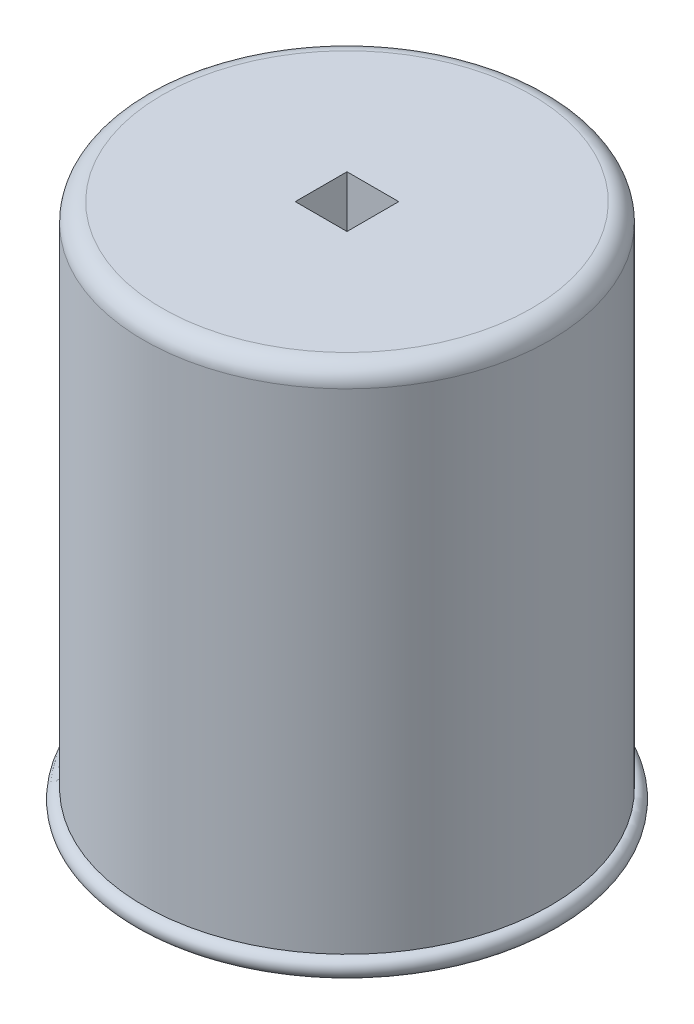
ISO-10303-21;
HEADER;
FILE_DESCRIPTION(('STEP AP214'),'2;1');
FILE_NAME('part.step','',(''),(''),'','','');
FILE_SCHEMA(('AUTOMOTIVE_DESIGN { 1 0 10303 214 1 1 1 1 }'));
ENDSEC;
DATA;
#1=APPLICATION_CONTEXT('core data for automotive mechanical design processes');
#2=APPLICATION_PROTOCOL_DEFINITION('international standard','automotive_design',2000,#1);
#3=PRODUCT_CONTEXT('',#1,'mechanical');
#4=PRODUCT('Part','Part','',(#3));
#5=PRODUCT_RELATED_PRODUCT_CATEGORY('part','',(#4));
#6=PRODUCT_DEFINITION_FORMATION('','',#4);
#7=PRODUCT_DEFINITION_CONTEXT('part definition',#1,'design');
#8=PRODUCT_DEFINITION('design','',#6,#7);
#9=PRODUCT_DEFINITION_SHAPE('','',#8);
#10=(LENGTH_UNIT() NAMED_UNIT(*) SI_UNIT(.MILLI.,.METRE.));
#11=(NAMED_UNIT(*) PLANE_ANGLE_UNIT() SI_UNIT($,.RADIAN.));
#12=(NAMED_UNIT(*) SI_UNIT($,.STERADIAN.) SOLID_ANGLE_UNIT());
#13=UNCERTAINTY_MEASURE_WITH_UNIT(LENGTH_MEASURE(1.E-05),#10,'distance_accuracy_value','');
#14=(GEOMETRIC_REPRESENTATION_CONTEXT(3) GLOBAL_UNCERTAINTY_ASSIGNED_CONTEXT((#13)) GLOBAL_UNIT_ASSIGNED_CONTEXT((#10,
#11,#12)) REPRESENTATION_CONTEXT('',''));
#15=CARTESIAN_POINT('',(0.,0.,0.));
#16=DIRECTION('',(0.,0.,1.));
#17=DIRECTION('',(1.,0.,0.));
#18=AXIS2_PLACEMENT_3D('',#15,#16,#17);
#19=CARTESIAN_POINT('',(0.,0.,0.));
#20=DIRECTION('',(0.,-1.,0.));
#21=DIRECTION('',(1.,0.,0.));
#22=AXIS2_PLACEMENT_3D('',#19,#20,#21);
#23=CYLINDRICAL_SURFACE('',#22,23.);
#24=CARTESIAN_POINT('',(0.,-220.,0.));
#25=DIRECTION('',(0.,-1.,0.));
#26=DIRECTION('',(1.,0.,0.));
#27=AXIS2_PLACEMENT_3D('',#24,#25,#26);
#28=CIRCLE('',#27,23.);
#29=CARTESIAN_POINT('',(23.0000000000001,-220.,0.));
#30=VERTEX_POINT('',#29);
#31=EDGE_CURVE('E287',#30,#30,#28,.T.);
#32=ORIENTED_EDGE('',*,*,#31,.T.);
#33=EDGE_LOOP('',(#32));
#34=FACE_BOUND('',#33,.T.);
#35=CARTESIAN_POINT('',(0.,-149.,0.));
#36=DIRECTION('',(0.,-1.,0.));
#37=DIRECTION('',(1.,0.,0.));
#38=AXIS2_PLACEMENT_3D('',#35,#36,#37);
#39=CIRCLE('',#38,23.);
#40=CARTESIAN_POINT('',(23.,-149.,0.));
#41=VERTEX_POINT('',#40);
#42=EDGE_CURVE('E290',#41,#41,#39,.T.);
#43=ORIENTED_EDGE('',*,*,#42,.F.);
#44=EDGE_LOOP('',(#43));
#45=FACE_BOUND('',#44,.T.);
#46=CARTESIAN_POINT('',(0.,-154.5,0.));
#47=DIRECTION('',(0.,-1.,0.));
#48=DIRECTION('',(0.,0.,1.));
#49=AXIS2_PLACEMENT_3D('',#46,#47,#48);
#50=CIRCLE('',#49,23.);
#51=CARTESIAN_POINT('',(6.63917525773196,-154.5,-22.0209298599564));
#52=VERTEX_POINT('',#51);
#53=CARTESIAN_POINT('',(6.63917525773196,-154.5,22.0209298599564));
#54=VERTEX_POINT('',#53);
#55=EDGE_CURVE('E187',#52,#54,#50,.T.);
#56=ORIENTED_EDGE('',*,*,#55,.T.);
#57=DIRECTION('',(0.,-1.,0.));
#58=VECTOR('',#57,1.);
#59=CARTESIAN_POINT('',(6.63917525773196,-154.5,22.0209298599564));
#60=LINE('',#59,#58);
#61=CARTESIAN_POINT('',(6.63917525773196,-214.5,22.0209298599564));
#62=VERTEX_POINT('',#61);
#63=EDGE_CURVE('E221',#54,#62,#60,.T.);
#64=ORIENTED_EDGE('',*,*,#63,.T.);
#65=CARTESIAN_POINT('',(0.,-214.5,0.));
#66=DIRECTION('',(0.,-1.,0.));
#67=DIRECTION('',(0.,0.,1.));
#68=AXIS2_PLACEMENT_3D('',#65,#66,#67);
#69=CIRCLE('',#68,23.);
#70=CARTESIAN_POINT('',(6.63917525773197,-214.5,-22.0209298599564));
#71=VERTEX_POINT('',#70);
#72=EDGE_CURVE('E206',#71,#62,#69,.T.);
#73=ORIENTED_EDGE('',*,*,#72,.F.);
#74=DIRECTION('',(0.,-1.,0.));
#75=VECTOR('',#74,1.);
#76=CARTESIAN_POINT('',(6.63917525773196,-154.5,-22.0209298599564));
#77=LINE('',#76,#75);
#78=EDGE_CURVE('E224',#52,#71,#77,.T.);
#79=ORIENTED_EDGE('',*,*,#78,.F.);
#80=EDGE_LOOP('',(#56,#64,#73,#79));
#81=FACE_BOUND('',#80,.T.);
#82=ADVANCED_FACE('F38',(#34,#45,#81),#23,.F.);
#83=CARTESIAN_POINT('',(0.,0.,0.));
#84=DIRECTION('',(0.,-1.,0.));
#85=DIRECTION('',(1.,0.,0.));
#86=AXIS2_PLACEMENT_3D('',#83,#84,#85);
#87=CYLINDRICAL_SURFACE('',#86,28.);
#88=CARTESIAN_POINT('',(0.,35.,0.));
#89=DIRECTION('',(0.,-1.,0.));
#90=DIRECTION('',(1.,0.,0.));
#91=AXIS2_PLACEMENT_3D('',#88,#89,#90);
#92=CIRCLE('',#91,28.);
#93=CARTESIAN_POINT('',(28.,35.,0.));
#94=VERTEX_POINT('',#93);
#95=EDGE_CURVE('E275',#94,#94,#92,.T.);
#96=ORIENTED_EDGE('',*,*,#95,.T.);
#97=EDGE_LOOP('',(#96));
#98=FACE_BOUND('',#97,.T.);
#99=CARTESIAN_POINT('',(0.,-225.,0.));
#100=DIRECTION('',(0.,-1.,0.));
#101=DIRECTION('',(1.,0.,0.));
#102=AXIS2_PLACEMENT_3D('',#99,#100,#101);
#103=CIRCLE('',#102,28.);
#104=CARTESIAN_POINT('',(28.,-225.,0.));
#105=VERTEX_POINT('',#104);
#106=EDGE_CURVE('E278',#105,#105,#103,.T.);
#107=ORIENTED_EDGE('',*,*,#106,.F.);
#108=EDGE_LOOP('',(#107));
#109=FACE_BOUND('',#108,.T.);
#110=CARTESIAN_POINT('',(0.,-154.5,0.));
#111=DIRECTION('',(0.,1.,0.));
#112=DIRECTION('',(0.,0.,-1.));
#113=AXIS2_PLACEMENT_3D('',#110,#111,#112);
#114=CIRCLE('',#113,28.);
#115=CARTESIAN_POINT('',(0.,-154.5,28.));
#116=VERTEX_POINT('',#115);
#117=CARTESIAN_POINT('',(0.,-154.5,-28.));
#118=VERTEX_POINT('',#117);
#119=EDGE_CURVE('E177',#116,#118,#114,.T.);
#120=ORIENTED_EDGE('',*,*,#119,.T.);
#121=DIRECTION('',(0.,-1.,0.));
#122=VECTOR('',#121,1.);
#123=CARTESIAN_POINT('',(0.,-154.5,-28.));
#124=LINE('',#123,#122);
#125=CARTESIAN_POINT('',(0.,-214.5,-28.));
#126=VERTEX_POINT('',#125);
#127=EDGE_CURVE('E232',#118,#126,#124,.T.);
#128=ORIENTED_EDGE('',*,*,#127,.T.);
#129=CARTESIAN_POINT('',(0.,-214.5,0.));
#130=DIRECTION('',(0.,1.,0.));
#131=DIRECTION('',(0.,0.,-1.));
#132=AXIS2_PLACEMENT_3D('',#129,#130,#131);
#133=CIRCLE('',#132,28.);
#134=CARTESIAN_POINT('',(0.,-214.5,28.));
#135=VERTEX_POINT('',#134);
#136=EDGE_CURVE('E172',#135,#126,#133,.T.);
#137=ORIENTED_EDGE('',*,*,#136,.F.);
#138=DIRECTION('',(0.,-1.,0.));
#139=VECTOR('',#138,1.);
#140=CARTESIAN_POINT('',(0.,-154.5,28.));
#141=LINE('',#140,#139);
#142=EDGE_CURVE('E196',#116,#135,#141,.T.);
#143=ORIENTED_EDGE('',*,*,#142,.F.);
#144=EDGE_LOOP('',(#120,#128,#137,#143));
#145=FACE_BOUND('',#144,.T.);
#146=ADVANCED_FACE('F321',(#98,#109,#145),#87,.T.);
#147=CARTESIAN_POINT('',(-23.,0.,0.));
#148=DIRECTION('',(0.,1.,0.));
#149=DIRECTION('',(-1.,0.,0.));
#150=AXIS2_PLACEMENT_3D('',#147,#148,#149);
#151=PLANE('',#150);
#152=CARTESIAN_POINT('',(0.,0.,0.));
#153=DIRECTION('',(0.,-1.,0.));
#154=DIRECTION('',(1.,0.,0.));
#155=AXIS2_PLACEMENT_3D('',#152,#153,#154);
#156=CIRCLE('',#155,23.);
#157=CARTESIAN_POINT('',(23.,0.,0.));
#158=VERTEX_POINT('',#157);
#159=EDGE_CURVE('E302',#158,#158,#156,.T.);
#160=ORIENTED_EDGE('',*,*,#159,.T.);
#161=EDGE_LOOP('',(#160));
#162=FACE_BOUND('',#161,.T.);
#163=DIRECTION('',(1.,0.,0.));
#164=VECTOR('',#163,1.);
#165=CARTESIAN_POINT('',(-14.,0.,-14.));
#166=LINE('',#165,#164);
#167=CARTESIAN_POINT('',(-14.,0.,-14.));
#168=VERTEX_POINT('',#167);
#169=CARTESIAN_POINT('',(14.,0.,-14.));
#170=VERTEX_POINT('',#169);
#171=EDGE_CURVE('E236',#168,#170,#166,.T.);
#172=ORIENTED_EDGE('',*,*,#171,.F.);
#173=DIRECTION('',(0.,0.,-1.));
#174=VECTOR('',#173,1.);
#175=CARTESIAN_POINT('',(-14.,0.,-14.));
#176=LINE('',#175,#174);
#177=CARTESIAN_POINT('',(-14.,0.,14.));
#178=VERTEX_POINT('',#177);
#179=EDGE_CURVE('E256',#178,#168,#176,.T.);
#180=ORIENTED_EDGE('',*,*,#179,.F.);
#181=DIRECTION('',(-1.,0.,0.));
#182=VECTOR('',#181,1.);
#183=CARTESIAN_POINT('',(-14.,0.,14.));
#184=LINE('',#183,#182);
#185=CARTESIAN_POINT('',(14.,0.,14.));
#186=VERTEX_POINT('',#185);
#187=EDGE_CURVE('E254',#186,#178,#184,.T.);
#188=ORIENTED_EDGE('',*,*,#187,.F.);
#189=DIRECTION('',(0.,0.,1.));
#190=VECTOR('',#189,1.);
#191=CARTESIAN_POINT('',(14.,0.,-14.));
#192=LINE('',#191,#190);
#193=EDGE_CURVE('E239',#170,#186,#192,.T.);
#194=ORIENTED_EDGE('',*,*,#193,.F.);
#195=EDGE_LOOP('',(#172,#180,#188,#194));
#196=FACE_BOUND('',#195,.T.);
#197=ADVANCED_FACE('F327',(#162,#196),#151,.F.);
#198=CARTESIAN_POINT('',(0.,0.,0.));
#199=DIRECTION('',(0.,-1.,0.));
#200=DIRECTION('',(1.,0.,0.));
#201=AXIS2_PLACEMENT_3D('',#198,#199,#200);
#202=CYLINDRICAL_SURFACE('',#201,23.);
#203=ORIENTED_EDGE('',*,*,#159,.F.);
#204=EDGE_LOOP('',(#203));
#205=FACE_BOUND('',#204,.T.);
#206=CARTESIAN_POINT('',(0.,-144.,0.));
#207=DIRECTION('',(0.,-1.,0.));
#208=DIRECTION('',(1.,0.,0.));
#209=AXIS2_PLACEMENT_3D('',#206,#207,#208);
#210=CIRCLE('',#209,23.);
#211=CARTESIAN_POINT('',(23.0000000000001,-144.,0.));
#212=VERTEX_POINT('',#211);
#213=EDGE_CURVE('E299',#212,#212,#210,.T.);
#214=ORIENTED_EDGE('',*,*,#213,.T.);
#215=EDGE_LOOP('',(#214));
#216=FACE_BOUND('',#215,.T.);
#217=ADVANCED_FACE('F345',(#205,#216),#202,.F.);
#218=CARTESIAN_POINT('',(-5.,-144.,0.));
#219=DIRECTION('',(0.,-1.,0.));
#220=DIRECTION('',(1.,0.,0.));
#221=AXIS2_PLACEMENT_3D('',#218,#219,#220);
#222=PLANE('',#221);
#223=DIRECTION('',(-1.,0.,0.));
#224=VECTOR('',#223,1.);
#225=CARTESIAN_POINT('',(11.5,-144.,-2.5));
#226=LINE('',#225,#224);
#227=CARTESIAN_POINT('',(16.5,-144.,-2.5));
#228=VERTEX_POINT('',#227);
#229=CARTESIAN_POINT('',(11.5,-144.,-2.5));
#230=VERTEX_POINT('',#229);
#231=EDGE_CURVE('E155',#228,#230,#226,.T.);
#232=ORIENTED_EDGE('',*,*,#231,.F.);
#233=DIRECTION('',(0.,0.,-1.));
#234=VECTOR('',#233,1.);
#235=CARTESIAN_POINT('',(16.5,-144.,2.5));
#236=LINE('',#235,#234);
#237=CARTESIAN_POINT('',(16.5,-144.,2.5));
#238=VERTEX_POINT('',#237);
#239=EDGE_CURVE('E162',#238,#228,#236,.T.);
#240=ORIENTED_EDGE('',*,*,#239,.F.);
#241=DIRECTION('',(1.,0.,0.));
#242=VECTOR('',#241,1.);
#243=CARTESIAN_POINT('',(11.5,-144.,2.5));
#244=LINE('',#243,#242);
#245=CARTESIAN_POINT('',(11.5,-144.,2.5));
#246=VERTEX_POINT('',#245);
#247=EDGE_CURVE('E167',#246,#238,#244,.T.);
#248=ORIENTED_EDGE('',*,*,#247,.F.);
#249=DIRECTION('',(0.,0.,1.));
#250=VECTOR('',#249,1.);
#251=CARTESIAN_POINT('',(11.5,-144.,2.5));
#252=LINE('',#251,#250);
#253=EDGE_CURVE('E53',#230,#246,#252,.T.);
#254=ORIENTED_EDGE('',*,*,#253,.F.);
#255=EDGE_LOOP('',(#232,#240,#248,#254));
#256=FACE_BOUND('',#255,.T.);
#257=ORIENTED_EDGE('',*,*,#213,.F.);
#258=EDGE_LOOP('',(#257));
#259=FACE_BOUND('',#258,.T.);
#260=CARTESIAN_POINT('',(0.,-144.,0.));
#261=DIRECTION('',(0.,-1.,0.));
#262=DIRECTION('',(1.,0.,0.));
#263=AXIS2_PLACEMENT_3D('',#260,#261,#262);
#264=CIRCLE('',#263,5.00000000000003);
#265=CARTESIAN_POINT('',(5.00000000000005,-144.,0.));
#266=VERTEX_POINT('',#265);
#267=EDGE_CURVE('E296',#266,#266,#264,.T.);
#268=ORIENTED_EDGE('',*,*,#267,.T.);
#269=EDGE_LOOP('',(#268));
#270=FACE_BOUND('',#269,.T.);
#271=ADVANCED_FACE('F169',(#256,#259,#270),#222,.F.);
#272=CARTESIAN_POINT('',(0.,0.,0.));
#273=DIRECTION('',(0.,-1.,0.));
#274=DIRECTION('',(1.,0.,0.));
#275=AXIS2_PLACEMENT_3D('',#272,#273,#274);
#276=CYLINDRICAL_SURFACE('',#275,5.00000000000003);
#277=ORIENTED_EDGE('',*,*,#267,.F.);
#278=EDGE_LOOP('',(#277));
#279=FACE_BOUND('',#278,.T.);
#280=CARTESIAN_POINT('',(0.,-149.,0.));
#281=DIRECTION('',(0.,-1.,0.));
#282=DIRECTION('',(1.,0.,0.));
#283=AXIS2_PLACEMENT_3D('',#280,#281,#282);
#284=CIRCLE('',#283,5.00000000000003);
#285=CARTESIAN_POINT('',(5.00000000000006,-149.,0.));
#286=VERTEX_POINT('',#285);
#287=EDGE_CURVE('E293',#286,#286,#284,.T.);
#288=ORIENTED_EDGE('',*,*,#287,.T.);
#289=EDGE_LOOP('',(#288));
#290=FACE_BOUND('',#289,.T.);
#291=ADVANCED_FACE('F338',(#279,#290),#276,.F.);
#292=CARTESIAN_POINT('',(-23.,-149.,0.));
#293=DIRECTION('',(0.,1.,0.));
#294=DIRECTION('',(-1.,0.,0.));
#295=AXIS2_PLACEMENT_3D('',#292,#293,#294);
#296=PLANE('',#295);
#297=DIRECTION('',(-1.,0.,0.));
#298=VECTOR('',#297,1.);
#299=CARTESIAN_POINT('',(11.5,-149.,2.5));
#300=LINE('',#299,#298);
#301=CARTESIAN_POINT('',(16.5,-149.,2.5));
#302=VERTEX_POINT('',#301);
#303=CARTESIAN_POINT('',(11.5,-149.,2.5));
#304=VERTEX_POINT('',#303);
#305=EDGE_CURVE('E681',#302,#304,#300,.T.);
#306=ORIENTED_EDGE('',*,*,#305,.F.);
#307=DIRECTION('',(0.,0.,1.));
#308=VECTOR('',#307,1.);
#309=CARTESIAN_POINT('',(16.5,-149.,2.5));
#310=LINE('',#309,#308);
#311=CARTESIAN_POINT('',(16.5,-149.,-2.5));
#312=VERTEX_POINT('',#311);
#313=EDGE_CURVE('E61',#312,#302,#310,.T.);
#314=ORIENTED_EDGE('',*,*,#313,.F.);
#315=DIRECTION('',(1.,0.,0.));
#316=VECTOR('',#315,1.);
#317=CARTESIAN_POINT('',(11.5,-149.,-2.5));
#318=LINE('',#317,#316);
#319=CARTESIAN_POINT('',(11.5,-149.,-2.5));
#320=VERTEX_POINT('',#319);
#321=EDGE_CURVE('E157',#320,#312,#318,.T.);
#322=ORIENTED_EDGE('',*,*,#321,.F.);
#323=DIRECTION('',(0.,0.,-1.));
#324=VECTOR('',#323,1.);
#325=CARTESIAN_POINT('',(11.5,-149.,2.5));
#326=LINE('',#325,#324);
#327=EDGE_CURVE('E683',#304,#320,#326,.T.);
#328=ORIENTED_EDGE('',*,*,#327,.F.);
#329=EDGE_LOOP('',(#306,#314,#322,#328));
#330=FACE_BOUND('',#329,.T.);
#331=ORIENTED_EDGE('',*,*,#287,.F.);
#332=EDGE_LOOP('',(#331));
#333=FACE_BOUND('',#332,.T.);
#334=ORIENTED_EDGE('',*,*,#42,.T.);
#335=EDGE_LOOP('',(#334));
#336=FACE_BOUND('',#335,.T.);
#337=ADVANCED_FACE('F335',(#330,#333,#336),#296,.F.);
#338=CARTESIAN_POINT('',(-4.99999999999997,-220.,0.));
#339=DIRECTION('',(0.,-1.,0.));
#340=DIRECTION('',(1.,0.,0.));
#341=AXIS2_PLACEMENT_3D('',#338,#339,#340);
#342=PLANE('',#341);
#343=ORIENTED_EDGE('',*,*,#31,.F.);
#344=EDGE_LOOP('',(#343));
#345=FACE_BOUND('',#344,.T.);
#346=CARTESIAN_POINT('',(0.,-220.,0.));
#347=DIRECTION('',(0.,-1.,0.));
#348=DIRECTION('',(1.,0.,0.));
#349=AXIS2_PLACEMENT_3D('',#346,#347,#348);
#350=CIRCLE('',#349,5.00000000000001);
#351=CARTESIAN_POINT('',(5.00000000000005,-220.,0.));
#352=VERTEX_POINT('',#351);
#353=EDGE_CURVE('E284',#352,#352,#350,.T.);
#354=ORIENTED_EDGE('',*,*,#353,.T.);
#355=EDGE_LOOP('',(#354));
#356=FACE_BOUND('',#355,.T.);
#357=ADVANCED_FACE('F333',(#345,#356),#342,.F.);
#358=CARTESIAN_POINT('',(0.,0.,0.));
#359=DIRECTION('',(0.,-1.,0.));
#360=DIRECTION('',(1.,0.,0.));
#361=AXIS2_PLACEMENT_3D('',#358,#359,#360);
#362=CYLINDRICAL_SURFACE('',#361,5.00000000000001);
#363=ORIENTED_EDGE('',*,*,#353,.F.);
#364=EDGE_LOOP('',(#363));
#365=FACE_BOUND('',#364,.T.);
#366=CARTESIAN_POINT('',(0.,-225.,0.));
#367=DIRECTION('',(0.,-1.,0.));
#368=DIRECTION('',(1.,0.,0.));
#369=AXIS2_PLACEMENT_3D('',#366,#367,#368);
#370=CIRCLE('',#369,5.00000000000001);
#371=CARTESIAN_POINT('',(5.00000000000005,-225.,0.));
#372=VERTEX_POINT('',#371);
#373=EDGE_CURVE('E281',#372,#372,#370,.T.);
#374=ORIENTED_EDGE('',*,*,#373,.T.);
#375=EDGE_LOOP('',(#374));
#376=FACE_BOUND('',#375,.T.);
#377=ADVANCED_FACE('F398',(#365,#376),#362,.F.);
#378=CARTESIAN_POINT('',(-28.,-225.,0.));
#379=DIRECTION('',(0.,1.,0.));
#380=DIRECTION('',(-1.,0.,0.));
#381=AXIS2_PLACEMENT_3D('',#378,#379,#380);
#382=PLANE('',#381);
#383=ORIENTED_EDGE('',*,*,#373,.F.);
#384=EDGE_LOOP('',(#383));
#385=FACE_BOUND('',#384,.T.);
#386=ORIENTED_EDGE('',*,*,#106,.T.);
#387=EDGE_LOOP('',(#386));
#388=FACE_BOUND('',#387,.T.);
#389=ADVANCED_FACE('F394',(#385,#388),#382,.F.);
#390=CARTESIAN_POINT('',(-105.,35.,0.));
#391=DIRECTION('',(0.,1.,0.));
#392=DIRECTION('',(-1.,0.,0.));
#393=AXIS2_PLACEMENT_3D('',#390,#391,#392);
#394=PLANE('',#393);
#395=ORIENTED_EDGE('',*,*,#95,.F.);
#396=EDGE_LOOP('',(#395));
#397=FACE_BOUND('',#396,.T.);
#398=CARTESIAN_POINT('',(0.,35.,0.));
#399=DIRECTION('',(0.,-1.,0.));
#400=DIRECTION('',(1.,0.,0.));
#401=AXIS2_PLACEMENT_3D('',#398,#399,#400);
#402=CIRCLE('',#401,105.);
#403=CARTESIAN_POINT('',(105.,35.,0.));
#404=VERTEX_POINT('',#403);
#405=EDGE_CURVE('E272',#404,#404,#402,.T.);
#406=ORIENTED_EDGE('',*,*,#405,.T.);
#407=EDGE_LOOP('',(#406));
#408=FACE_BOUND('',#407,.T.);
#409=ADVANCED_FACE('F391',(#397,#408),#394,.F.);
#410=CARTESIAN_POINT('',(0.,0.,0.));
#411=DIRECTION('',(0.,-1.,0.));
#412=DIRECTION('',(1.,0.,0.));
#413=AXIS2_PLACEMENT_3D('',#410,#411,#412);
#414=CYLINDRICAL_SURFACE('',#413,105.);
#415=ORIENTED_EDGE('',*,*,#405,.F.);
#416=EDGE_LOOP('',(#415));
#417=FACE_BOUND('',#416,.T.);
#418=CARTESIAN_POINT('',(0.,-240.,0.));
#419=DIRECTION('',(0.,-1.,0.));
#420=DIRECTION('',(1.,0.,0.));
#421=AXIS2_PLACEMENT_3D('',#418,#419,#420);
#422=CIRCLE('',#421,105.);
#423=CARTESIAN_POINT('',(105.,-240.,0.));
#424=VERTEX_POINT('',#423);
#425=EDGE_CURVE('E269',#424,#424,#422,.T.);
#426=ORIENTED_EDGE('',*,*,#425,.T.);
#427=EDGE_LOOP('',(#426));
#428=FACE_BOUND('',#427,.T.);
#429=ADVANCED_FACE('F387',(#417,#428),#414,.F.);
#430=CARTESIAN_POINT('',(0.,-240.,0.));
#431=DIRECTION('',(0.,-1.,0.));
#432=DIRECTION('',(1.,0.,0.));
#433=AXIS2_PLACEMENT_3D('',#430,#431,#432);
#434=TOROIDAL_SURFACE('',#433,110.,5.00000000000001);
#435=ORIENTED_EDGE('',*,*,#425,.F.);
#436=EDGE_LOOP('',(#435));
#437=FACE_BOUND('',#436,.T.);
#438=CARTESIAN_POINT('',(0.,-235.,0.));
#439=DIRECTION('',(0.,-1.,0.));
#440=DIRECTION('',(1.,0.,0.));
#441=AXIS2_PLACEMENT_3D('',#438,#439,#440);
#442=CIRCLE('',#441,110.);
#443=CARTESIAN_POINT('',(110.,-235.,0.));
#444=VERTEX_POINT('',#443);
#445=EDGE_CURVE('E259',#444,#444,#442,.T.);
#446=ORIENTED_EDGE('',*,*,#445,.T.);
#447=EDGE_LOOP('',(#446));
#448=FACE_BOUND('',#447,.T.);
#449=ADVANCED_FACE('F381',(#437,#448),#434,.T.);
#450=CARTESIAN_POINT('',(0.,0.,0.));
#451=DIRECTION('',(0.,-1.,0.));
#452=DIRECTION('',(1.,0.,0.));
#453=AXIS2_PLACEMENT_3D('',#450,#451,#452);
#454=CYLINDRICAL_SURFACE('',#453,110.);
#455=CARTESIAN_POINT('',(0.,30.,0.));
#456=DIRECTION('',(0.,-1.,0.));
#457=DIRECTION('',(1.,0.,0.));
#458=AXIS2_PLACEMENT_3D('',#455,#456,#457);
#459=CIRCLE('',#458,110.);
#460=CARTESIAN_POINT('',(110.,30.,0.));
#461=VERTEX_POINT('',#460);
#462=EDGE_CURVE('E46',#461,#461,#459,.T.);
#463=ORIENTED_EDGE('',*,*,#462,.T.);
#464=EDGE_LOOP('',(#463));
#465=FACE_BOUND('',#464,.T.);
#466=ORIENTED_EDGE('',*,*,#445,.F.);
#467=EDGE_LOOP('',(#466));
#468=FACE_BOUND('',#467,.T.);
#469=ADVANCED_FACE('F307',(#465,#468),#454,.T.);
#470=CARTESIAN_POINT('',(0.,40.,0.));
#471=DIRECTION('',(0.,-1.,0.));
#472=DIRECTION('',(1.,0.,0.));
#473=AXIS2_PLACEMENT_3D('',#470,#471,#472);
#474=PLANE('',#473);
#475=CARTESIAN_POINT('',(0.,40.,0.));
#476=DIRECTION('',(0.,-1.,0.));
#477=DIRECTION('',(1.,0.,0.));
#478=AXIS2_PLACEMENT_3D('',#475,#476,#477);
#479=CIRCLE('',#478,100.);
#480=CARTESIAN_POINT('',(100.,40.,0.));
#481=VERTEX_POINT('',#480);
#482=EDGE_CURVE('E11',#481,#481,#479,.F.);
#483=ORIENTED_EDGE('',*,*,#482,.T.);
#484=EDGE_LOOP('',(#483));
#485=FACE_BOUND('',#484,.T.);
#486=DIRECTION('',(-1.,0.,0.));
#487=VECTOR('',#486,1.);
#488=CARTESIAN_POINT('',(-14.,40.,-14.));
#489=LINE('',#488,#487);
#490=CARTESIAN_POINT('',(14.,40.,-14.));
#491=VERTEX_POINT('',#490);
#492=CARTESIAN_POINT('',(-14.,40.,-14.));
#493=VERTEX_POINT('',#492);
#494=EDGE_CURVE('E246',#491,#493,#489,.T.);
#495=ORIENTED_EDGE('',*,*,#494,.F.);
#496=DIRECTION('',(0.,0.,-1.));
#497=VECTOR('',#496,1.);
#498=CARTESIAN_POINT('',(14.,40.,-14.));
#499=LINE('',#498,#497);
#500=CARTESIAN_POINT('',(14.,40.,14.));
#501=VERTEX_POINT('',#500);
#502=EDGE_CURVE('E249',#501,#491,#499,.T.);
#503=ORIENTED_EDGE('',*,*,#502,.F.);
#504=DIRECTION('',(1.,0.,0.));
#505=VECTOR('',#504,1.);
#506=CARTESIAN_POINT('',(-14.,40.,14.));
#507=LINE('',#506,#505);
#508=CARTESIAN_POINT('',(-14.,40.,14.));
#509=VERTEX_POINT('',#508);
#510=EDGE_CURVE('E240',#509,#501,#507,.T.);
#511=ORIENTED_EDGE('',*,*,#510,.F.);
#512=DIRECTION('',(0.,0.,1.));
#513=VECTOR('',#512,1.);
#514=CARTESIAN_POINT('',(-14.,40.,-14.));
#515=LINE('',#514,#513);
#516=EDGE_CURVE('E243',#493,#509,#515,.T.);
#517=ORIENTED_EDGE('',*,*,#516,.F.);
#518=EDGE_LOOP('',(#495,#503,#511,#517));
#519=FACE_BOUND('',#518,.T.);
#520=ADVANCED_FACE('F372',(#485,#519),#474,.F.);
#521=CARTESIAN_POINT('',(14.,-245.001,-14.));
#522=DIRECTION('',(1.,0.,0.));
#523=DIRECTION('',(0.,1.,0.));
#524=AXIS2_PLACEMENT_3D('',#521,#522,#523);
#525=PLANE('',#524);
#526=ORIENTED_EDGE('',*,*,#193,.T.);
#527=DIRECTION('',(0.,1.,0.));
#528=VECTOR('',#527,1.);
#529=CARTESIAN_POINT('',(14.,-245.001,14.));
#530=LINE('',#529,#528);
#531=EDGE_CURVE('E262',#186,#501,#530,.T.);
#532=ORIENTED_EDGE('',*,*,#531,.T.);
#533=ORIENTED_EDGE('',*,*,#502,.T.);
#534=DIRECTION('',(0.,1.,0.));
#535=VECTOR('',#534,1.);
#536=CARTESIAN_POINT('',(14.,-245.001,-14.));
#537=LINE('',#536,#535);
#538=EDGE_CURVE('E235',#170,#491,#537,.T.);
#539=ORIENTED_EDGE('',*,*,#538,.F.);
#540=EDGE_LOOP('',(#526,#532,#533,#539));
#541=FACE_BOUND('',#540,.T.);
#542=ADVANCED_FACE('F370',(#541),#525,.F.);
#543=CARTESIAN_POINT('',(-14.,-245.001,14.));
#544=DIRECTION('',(0.,0.,1.));
#545=DIRECTION('',(1.,0.,0.));
#546=AXIS2_PLACEMENT_3D('',#543,#544,#545);
#547=PLANE('',#546);
#548=ORIENTED_EDGE('',*,*,#187,.T.);
#549=DIRECTION('',(0.,1.,0.));
#550=VECTOR('',#549,1.);
#551=CARTESIAN_POINT('',(-14.,-245.001,14.));
#552=LINE('',#551,#550);
#553=EDGE_CURVE('E264',#178,#509,#552,.T.);
#554=ORIENTED_EDGE('',*,*,#553,.T.);
#555=ORIENTED_EDGE('',*,*,#510,.T.);
#556=ORIENTED_EDGE('',*,*,#531,.F.);
#557=EDGE_LOOP('',(#548,#554,#555,#556));
#558=FACE_BOUND('',#557,.T.);
#559=ADVANCED_FACE('F367',(#558),#547,.F.);
#560=CARTESIAN_POINT('',(-14.,-245.001,-14.));
#561=DIRECTION('',(-1.,0.,0.));
#562=DIRECTION('',(0.,-1.,0.));
#563=AXIS2_PLACEMENT_3D('',#560,#561,#562);
#564=PLANE('',#563);
#565=ORIENTED_EDGE('',*,*,#179,.T.);
#566=DIRECTION('',(0.,1.,0.));
#567=VECTOR('',#566,1.);
#568=CARTESIAN_POINT('',(-14.,-245.001,-14.));
#569=LINE('',#568,#567);
#570=EDGE_CURVE('E251',#168,#493,#569,.T.);
#571=ORIENTED_EDGE('',*,*,#570,.T.);
#572=ORIENTED_EDGE('',*,*,#516,.T.);
#573=ORIENTED_EDGE('',*,*,#553,.F.);
#574=EDGE_LOOP('',(#565,#571,#572,#573));
#575=FACE_BOUND('',#574,.T.);
#576=ADVANCED_FACE('F364',(#575),#564,.F.);
#577=CARTESIAN_POINT('',(-14.,-245.001,-14.));
#578=DIRECTION('',(0.,0.,-1.));
#579=DIRECTION('',(-1.,0.,0.));
#580=AXIS2_PLACEMENT_3D('',#577,#578,#579);
#581=PLANE('',#580);
#582=ORIENTED_EDGE('',*,*,#171,.T.);
#583=ORIENTED_EDGE('',*,*,#538,.T.);
#584=ORIENTED_EDGE('',*,*,#494,.T.);
#585=ORIENTED_EDGE('',*,*,#570,.F.);
#586=EDGE_LOOP('',(#582,#583,#584,#585));
#587=FACE_BOUND('',#586,.T.);
#588=ADVANCED_FACE('F359',(#587),#581,.F.);
#589=CARTESIAN_POINT('',(0.,-154.5,-25.5));
#590=DIRECTION('',(1.,0.,0.));
#591=DIRECTION('',(0.,0.,-1.));
#592=AXIS2_PLACEMENT_3D('',#589,#590,#591);
#593=PLANE('',#592);
#594=DIRECTION('',(0.,0.,1.));
#595=VECTOR('',#594,1.);
#596=CARTESIAN_POINT('',(0.,-214.5,-25.5));
#597=LINE('',#596,#595);
#598=CARTESIAN_POINT('',(0.,-214.5,-25.5));
#599=VERTEX_POINT('',#598);
#600=EDGE_CURVE('E199',#126,#599,#597,.T.);
#601=ORIENTED_EDGE('',*,*,#600,.F.);
#602=ORIENTED_EDGE('',*,*,#127,.F.);
#603=DIRECTION('',(0.,0.,1.));
#604=VECTOR('',#603,1.);
#605=CARTESIAN_POINT('',(0.,-154.5,-25.5));
#606=LINE('',#605,#604);
#607=CARTESIAN_POINT('',(0.,-154.5,-25.5));
#608=VERTEX_POINT('',#607);
#609=EDGE_CURVE('E180',#118,#608,#606,.T.);
#610=ORIENTED_EDGE('',*,*,#609,.T.);
#611=DIRECTION('',(0.,-1.,0.));
#612=VECTOR('',#611,1.);
#613=CARTESIAN_POINT('',(0.,-154.5,-25.5));
#614=LINE('',#613,#612);
#615=EDGE_CURVE('E229',#608,#599,#614,.T.);
#616=ORIENTED_EDGE('',*,*,#615,.T.);
#617=EDGE_LOOP('',(#601,#602,#610,#616));
#618=FACE_BOUND('',#617,.T.);
#619=ADVANCED_FACE('F425',(#618),#593,.T.);
#620=CARTESIAN_POINT('',(0.,-154.5,-7.04297731246584E-13));
#621=DIRECTION('',(0.,-1.,0.));
#622=DIRECTION('',(0.,0.,-1.));
#623=AXIS2_PLACEMENT_3D('',#620,#621,#622);
#624=CYLINDRICAL_SURFACE('',#623,25.4999999999993);
#625=CARTESIAN_POINT('',(0.,-214.5,-7.04297731246584E-13));
#626=DIRECTION('',(0.,-1.,0.));
#627=DIRECTION('',(0.,0.,-1.));
#628=AXIS2_PLACEMENT_3D('',#625,#626,#627);
#629=CIRCLE('',#628,25.4999999999993);
#630=CARTESIAN_POINT('',(7.36082474226804,-214.5,-24.4145091925603));
#631=VERTEX_POINT('',#630);
#632=EDGE_CURVE('E201',#599,#631,#629,.T.);
#633=ORIENTED_EDGE('',*,*,#632,.F.);
#634=ORIENTED_EDGE('',*,*,#615,.F.);
#635=CARTESIAN_POINT('',(0.,-154.5,-7.04297731246584E-13));
#636=DIRECTION('',(0.,-1.,0.));
#637=DIRECTION('',(0.,0.,-1.));
#638=AXIS2_PLACEMENT_3D('',#635,#636,#637);
#639=CIRCLE('',#638,25.4999999999993);
#640=CARTESIAN_POINT('',(7.36082474226804,-154.5,-24.4145091925603));
#641=VERTEX_POINT('',#640);
#642=EDGE_CURVE('E183',#608,#641,#639,.T.);
#643=ORIENTED_EDGE('',*,*,#642,.T.);
#644=DIRECTION('',(0.,-1.,0.));
#645=VECTOR('',#644,1.);
#646=CARTESIAN_POINT('',(7.36082474226804,-154.5,-24.4145091925603));
#647=LINE('',#646,#645);
#648=EDGE_CURVE('E226',#641,#631,#647,.T.);
#649=ORIENTED_EDGE('',*,*,#648,.T.);
#650=EDGE_LOOP('',(#633,#634,#643,#649));
#651=FACE_BOUND('',#650,.T.);
#652=ADVANCED_FACE('F449',(#651),#624,.T.);
#653=CARTESIAN_POINT('',(6.63917525773196,-154.5,-22.0209298599564));
#654=DIRECTION('',(0.957431733041583,0.,0.288659793814434));
#655=DIRECTION('',(0.288659793814434,0.,-0.957431733041583));
#656=AXIS2_PLACEMENT_3D('',#653,#654,#655);
#657=PLANE('',#656);
#658=DIRECTION('',(-0.288659793814434,0.,0.957431733041583));
#659=VECTOR('',#658,1.);
#660=CARTESIAN_POINT('',(6.63917525773196,-214.5,-22.0209298599564));
#661=LINE('',#660,#659);
#662=EDGE_CURVE('E203',#631,#71,#661,.T.);
#663=ORIENTED_EDGE('',*,*,#662,.F.);
#664=ORIENTED_EDGE('',*,*,#648,.F.);
#665=DIRECTION('',(-0.288659793814434,0.,0.957431733041583));
#666=VECTOR('',#665,1.);
#667=CARTESIAN_POINT('',(6.63917525773196,-154.5,-22.0209298599564));
#668=LINE('',#667,#666);
#669=EDGE_CURVE('E185',#641,#52,#668,.T.);
#670=ORIENTED_EDGE('',*,*,#669,.T.);
#671=ORIENTED_EDGE('',*,*,#78,.T.);
#672=EDGE_LOOP('',(#663,#664,#670,#671));
#673=FACE_BOUND('',#672,.T.);
#674=ADVANCED_FACE('F445',(#673),#657,.T.);
#675=CARTESIAN_POINT('',(7.36082474226804,-154.5,24.4145091925604));
#676=DIRECTION('',(0.957431733041583,0.,-0.288659793814433));
#677=DIRECTION('',(-0.288659793814433,0.,-0.957431733041583));
#678=AXIS2_PLACEMENT_3D('',#675,#676,#677);
#679=PLANE('',#678);
#680=DIRECTION('',(0.288659793814433,0.,0.957431733041583));
#681=VECTOR('',#680,1.);
#682=CARTESIAN_POINT('',(7.36082474226804,-214.5,24.4145091925604));
#683=LINE('',#682,#681);
#684=CARTESIAN_POINT('',(7.36082474226804,-214.5,24.4145091925604));
#685=VERTEX_POINT('',#684);
#686=EDGE_CURVE('E208',#62,#685,#683,.T.);
#687=ORIENTED_EDGE('',*,*,#686,.F.);
#688=ORIENTED_EDGE('',*,*,#63,.F.);
#689=DIRECTION('',(0.288659793814433,0.,0.957431733041583));
#690=VECTOR('',#689,1.);
#691=CARTESIAN_POINT('',(7.36082474226804,-154.5,24.4145091925604));
#692=LINE('',#691,#690);
#693=CARTESIAN_POINT('',(7.36082474226804,-154.5,24.4145091925604));
#694=VERTEX_POINT('',#693);
#695=EDGE_CURVE('E190',#54,#694,#692,.T.);
#696=ORIENTED_EDGE('',*,*,#695,.T.);
#697=DIRECTION('',(0.,-1.,0.));
#698=VECTOR('',#697,1.);
#699=CARTESIAN_POINT('',(7.36082474226804,-154.5,24.4145091925604));
#700=LINE('',#699,#698);
#701=EDGE_CURVE('E218',#694,#685,#700,.T.);
#702=ORIENTED_EDGE('',*,*,#701,.T.);
#703=EDGE_LOOP('',(#687,#688,#696,#702));
#704=FACE_BOUND('',#703,.T.);
#705=ADVANCED_FACE('F456',(#704),#679,.T.);
#706=CARTESIAN_POINT('',(0.,-154.5,0.));
#707=DIRECTION('',(0.,-1.,0.));
#708=DIRECTION('',(0.,0.,-1.));
#709=AXIS2_PLACEMENT_3D('',#706,#707,#708);
#710=CYLINDRICAL_SURFACE('',#709,25.5);
#711=CARTESIAN_POINT('',(0.,-214.5,0.));
#712=DIRECTION('',(0.,-1.,0.));
#713=DIRECTION('',(0.,0.,1.));
#714=AXIS2_PLACEMENT_3D('',#711,#712,#713);
#715=CIRCLE('',#714,25.5);
#716=CARTESIAN_POINT('',(0.,-214.5,25.5));
#717=VERTEX_POINT('',#716);
#718=EDGE_CURVE('E210',#685,#717,#715,.T.);
#719=ORIENTED_EDGE('',*,*,#718,.F.);
#720=ORIENTED_EDGE('',*,*,#701,.F.);
#721=CARTESIAN_POINT('',(0.,-154.5,0.));
#722=DIRECTION('',(0.,-1.,0.));
#723=DIRECTION('',(0.,0.,1.));
#724=AXIS2_PLACEMENT_3D('',#721,#722,#723);
#725=CIRCLE('',#724,25.5);
#726=CARTESIAN_POINT('',(0.,-154.5,25.5));
#727=VERTEX_POINT('',#726);
#728=EDGE_CURVE('E192',#694,#727,#725,.T.);
#729=ORIENTED_EDGE('',*,*,#728,.T.);
#730=DIRECTION('',(0.,-1.,0.));
#731=VECTOR('',#730,1.);
#732=CARTESIAN_POINT('',(0.,-154.5,25.5));
#733=LINE('',#732,#731);
#734=EDGE_CURVE('E215',#727,#717,#733,.T.);
#735=ORIENTED_EDGE('',*,*,#734,.T.);
#736=EDGE_LOOP('',(#719,#720,#729,#735));
#737=FACE_BOUND('',#736,.T.);
#738=ADVANCED_FACE('F435',(#737),#710,.T.);
#739=CARTESIAN_POINT('',(0.,-154.5,28.));
#740=DIRECTION('',(1.,0.,0.));
#741=DIRECTION('',(0.,0.,-1.));
#742=AXIS2_PLACEMENT_3D('',#739,#740,#741);
#743=PLANE('',#742);
#744=DIRECTION('',(0.,0.,1.));
#745=VECTOR('',#744,1.);
#746=CARTESIAN_POINT('',(0.,-214.5,28.));
#747=LINE('',#746,#745);
#748=EDGE_CURVE('E181',#717,#135,#747,.T.);
#749=ORIENTED_EDGE('',*,*,#748,.F.);
#750=ORIENTED_EDGE('',*,*,#734,.F.);
#751=DIRECTION('',(0.,0.,1.));
#752=VECTOR('',#751,1.);
#753=CARTESIAN_POINT('',(0.,-154.5,28.));
#754=LINE('',#753,#752);
#755=EDGE_CURVE('E194',#727,#116,#754,.T.);
#756=ORIENTED_EDGE('',*,*,#755,.T.);
#757=ORIENTED_EDGE('',*,*,#142,.T.);
#758=EDGE_LOOP('',(#749,#750,#756,#757));
#759=FACE_BOUND('',#758,.T.);
#760=ADVANCED_FACE('F433',(#759),#743,.T.);
#761=CARTESIAN_POINT('',(0.,-154.5,0.));
#762=DIRECTION('',(0.,-1.,0.));
#763=DIRECTION('',(0.,0.,-1.));
#764=AXIS2_PLACEMENT_3D('',#761,#762,#763);
#765=PLANE('',#764);
#766=ORIENTED_EDGE('',*,*,#119,.F.);
#767=ORIENTED_EDGE('',*,*,#755,.F.);
#768=ORIENTED_EDGE('',*,*,#728,.F.);
#769=ORIENTED_EDGE('',*,*,#695,.F.);
#770=ORIENTED_EDGE('',*,*,#55,.F.);
#771=ORIENTED_EDGE('',*,*,#669,.F.);
#772=ORIENTED_EDGE('',*,*,#642,.F.);
#773=ORIENTED_EDGE('',*,*,#609,.F.);
#774=EDGE_LOOP('',(#766,#767,#768,#769,#770,#771,#772,#773));
#775=FACE_BOUND('',#774,.T.);
#776=ADVANCED_FACE('F419',(#775),#765,.T.);
#777=CARTESIAN_POINT('',(0.,-214.5,0.));
#778=DIRECTION('',(0.,-1.,0.));
#779=DIRECTION('',(0.,0.,-1.));
#780=AXIS2_PLACEMENT_3D('',#777,#778,#779);
#781=PLANE('',#780);
#782=ORIENTED_EDGE('',*,*,#136,.T.);
#783=ORIENTED_EDGE('',*,*,#600,.T.);
#784=ORIENTED_EDGE('',*,*,#632,.T.);
#785=ORIENTED_EDGE('',*,*,#662,.T.);
#786=ORIENTED_EDGE('',*,*,#72,.T.);
#787=ORIENTED_EDGE('',*,*,#686,.T.);
#788=ORIENTED_EDGE('',*,*,#718,.T.);
#789=ORIENTED_EDGE('',*,*,#748,.T.);
#790=EDGE_LOOP('',(#782,#783,#784,#785,#786,#787,#788,#789));
#791=FACE_BOUND('',#790,.T.);
#792=ADVANCED_FACE('F428',(#791),#781,.F.);
#793=CARTESIAN_POINT('',(16.5,40.0010000000001,2.5));
#794=DIRECTION('',(1.,0.,0.));
#795=DIRECTION('',(0.,1.,0.));
#796=AXIS2_PLACEMENT_3D('',#793,#794,#795);
#797=PLANE('',#796);
#798=ORIENTED_EDGE('',*,*,#239,.T.);
#799=DIRECTION('',(0.,-1.,0.));
#800=VECTOR('',#799,1.);
#801=CARTESIAN_POINT('',(16.5,40.0010000000001,-2.5));
#802=LINE('',#801,#800);
#803=EDGE_CURVE('E151',#228,#312,#802,.T.);
#804=ORIENTED_EDGE('',*,*,#803,.T.);
#805=ORIENTED_EDGE('',*,*,#313,.T.);
#806=DIRECTION('',(0.,-1.,0.));
#807=VECTOR('',#806,1.);
#808=CARTESIAN_POINT('',(16.5,40.0010000000001,2.5));
#809=LINE('',#808,#807);
#810=EDGE_CURVE('E159',#238,#302,#809,.T.);
#811=ORIENTED_EDGE('',*,*,#810,.F.);
#812=EDGE_LOOP('',(#798,#804,#805,#811));
#813=FACE_BOUND('',#812,.T.);
#814=ADVANCED_FACE('F163',(#813),#797,.F.);
#815=CARTESIAN_POINT('',(11.5,40.0010000000001,-2.5));
#816=DIRECTION('',(0.,0.,-1.));
#817=DIRECTION('',(-1.,0.,0.));
#818=AXIS2_PLACEMENT_3D('',#815,#816,#817);
#819=PLANE('',#818);
#820=ORIENTED_EDGE('',*,*,#231,.T.);
#821=DIRECTION('',(0.,-1.,0.));
#822=VECTOR('',#821,1.);
#823=CARTESIAN_POINT('',(11.5,40.0010000000001,-2.5));
#824=LINE('',#823,#822);
#825=EDGE_CURVE('E158',#230,#320,#824,.T.);
#826=ORIENTED_EDGE('',*,*,#825,.T.);
#827=ORIENTED_EDGE('',*,*,#321,.T.);
#828=ORIENTED_EDGE('',*,*,#803,.F.);
#829=EDGE_LOOP('',(#820,#826,#827,#828));
#830=FACE_BOUND('',#829,.T.);
#831=ADVANCED_FACE('F153',(#830),#819,.F.);
#832=CARTESIAN_POINT('',(11.5,40.0010000000001,2.5));
#833=DIRECTION('',(-1.,0.,0.));
#834=DIRECTION('',(0.,0.,1.));
#835=AXIS2_PLACEMENT_3D('',#832,#833,#834);
#836=PLANE('',#835);
#837=ORIENTED_EDGE('',*,*,#253,.T.);
#838=DIRECTION('',(0.,-1.,0.));
#839=VECTOR('',#838,1.);
#840=CARTESIAN_POINT('',(11.5,40.0010000000001,2.5));
#841=LINE('',#840,#839);
#842=EDGE_CURVE('E686',#246,#304,#841,.T.);
#843=ORIENTED_EDGE('',*,*,#842,.T.);
#844=ORIENTED_EDGE('',*,*,#327,.T.);
#845=ORIENTED_EDGE('',*,*,#825,.F.);
#846=EDGE_LOOP('',(#837,#843,#844,#845));
#847=FACE_BOUND('',#846,.T.);
#848=ADVANCED_FACE('F316',(#847),#836,.F.);
#849=CARTESIAN_POINT('',(11.5,40.0010000000001,2.5));
#850=DIRECTION('',(0.,0.,1.));
#851=DIRECTION('',(1.,0.,0.));
#852=AXIS2_PLACEMENT_3D('',#849,#850,#851);
#853=PLANE('',#852);
#854=ORIENTED_EDGE('',*,*,#247,.T.);
#855=ORIENTED_EDGE('',*,*,#810,.T.);
#856=ORIENTED_EDGE('',*,*,#305,.T.);
#857=ORIENTED_EDGE('',*,*,#842,.F.);
#858=EDGE_LOOP('',(#854,#855,#856,#857));
#859=FACE_BOUND('',#858,.T.);
#860=ADVANCED_FACE('F311',(#859),#853,.F.);
#861=CARTESIAN_POINT('',(0.,30.,0.));
#862=DIRECTION('',(0.,-1.,0.));
#863=DIRECTION('',(1.,0.,0.));
#864=AXIS2_PLACEMENT_3D('',#861,#862,#863);
#865=TOROIDAL_SURFACE('',#864,100.,10.);
#866=ORIENTED_EDGE('',*,*,#482,.F.);
#867=EDGE_LOOP('',(#866));
#868=FACE_BOUND('',#867,.T.);
#869=ORIENTED_EDGE('',*,*,#462,.F.);
#870=EDGE_LOOP('',(#869));
#871=FACE_BOUND('',#870,.T.);
#872=ADVANCED_FACE('F40',(#868,#871),#865,.T.);
#873=CLOSED_SHELL('',(#82,#146,#197,#217,#271,#291,#337,#357,#377,#389,#409,#429,#449,#469,#520,
#542,#559,#576,#588,#619,#652,#674,#705,#738,#760,#776,#792,#814,#831,#848,#860,#872));
#874=MANIFOLD_SOLID_BREP('B2',#873);
#875=ADVANCED_BREP_SHAPE_REPRESENTATION('',(#18,#874),#14);
#876=SHAPE_DEFINITION_REPRESENTATION(#9,#875);
ENDSEC;
END-ISO-10303-21;
